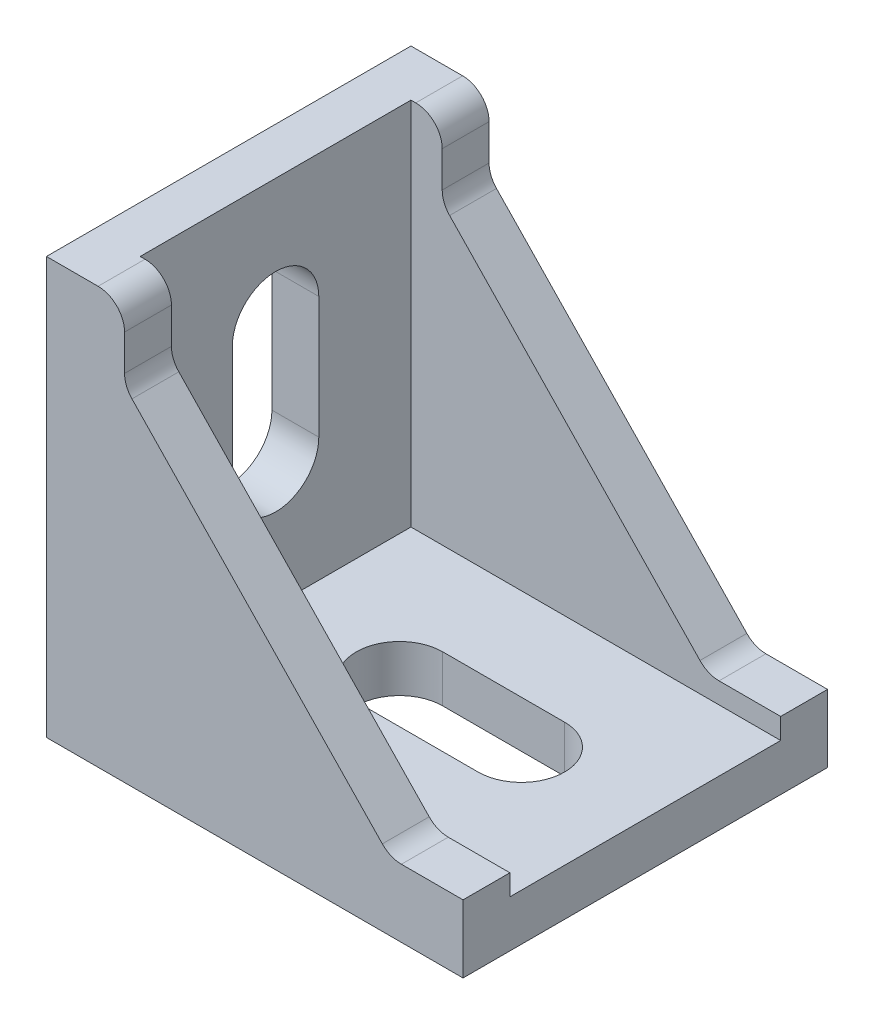
ISO-10303-21;
HEADER;
FILE_DESCRIPTION(('STEP AP214'),'2;1');
FILE_NAME('part.step','',(''),(''),'','','');
FILE_SCHEMA(('AUTOMOTIVE_DESIGN { 1 0 10303 214 1 1 1 1 }'));
ENDSEC;
DATA;
#1=APPLICATION_CONTEXT('core data for automotive mechanical design processes');
#2=APPLICATION_PROTOCOL_DEFINITION('international standard','automotive_design',2000,#1);
#3=PRODUCT_CONTEXT('',#1,'mechanical');
#4=PRODUCT('Part','Part','',(#3));
#5=PRODUCT_RELATED_PRODUCT_CATEGORY('part','',(#4));
#6=PRODUCT_DEFINITION_FORMATION('','',#4);
#7=PRODUCT_DEFINITION_CONTEXT('part definition',#1,'design');
#8=PRODUCT_DEFINITION('design','',#6,#7);
#9=PRODUCT_DEFINITION_SHAPE('','',#8);
#10=(LENGTH_UNIT() NAMED_UNIT(*) SI_UNIT(.MILLI.,.METRE.));
#11=(NAMED_UNIT(*) PLANE_ANGLE_UNIT() SI_UNIT($,.RADIAN.));
#12=(NAMED_UNIT(*) SI_UNIT($,.STERADIAN.) SOLID_ANGLE_UNIT());
#13=UNCERTAINTY_MEASURE_WITH_UNIT(LENGTH_MEASURE(1.E-05),#10,'distance_accuracy_value','');
#14=(GEOMETRIC_REPRESENTATION_CONTEXT(3) GLOBAL_UNCERTAINTY_ASSIGNED_CONTEXT((#13)) GLOBAL_UNIT_ASSIGNED_CONTEXT((#10,
#11,#12)) REPRESENTATION_CONTEXT('',''));
#15=CARTESIAN_POINT('',(0.,0.,0.));
#16=DIRECTION('',(0.,0.,1.));
#17=DIRECTION('',(1.,0.,0.));
#18=AXIS2_PLACEMENT_3D('',#15,#16,#17);
#19=CARTESIAN_POINT('',(-15.4999999999926,17.75,17.5));
#20=DIRECTION('',(-1.,0.,0.));
#21=DIRECTION('',(0.,0.,1.));
#22=AXIS2_PLACEMENT_3D('',#19,#20,#21);
#23=PLANE('',#22);
#24=DIRECTION('',(0.,-1.,0.));
#25=VECTOR('',#24,1.);
#26=CARTESIAN_POINT('',(-15.4999999999926,5.85,4.15));
#27=LINE('',#26,#25);
#28=CARTESIAN_POINT('',(-15.4999999999926,5.85,4.15));
#29=VERTEX_POINT('',#28);
#30=CARTESIAN_POINT('',(-15.4999999999926,-5.85,4.15));
#31=VERTEX_POINT('',#30);
#32=EDGE_CURVE('E282',#29,#31,#27,.T.);
#33=ORIENTED_EDGE('',*,*,#32,.F.);
#34=CARTESIAN_POINT('',(-15.4999999999926,5.85,0.));
#35=DIRECTION('',(1.,0.,0.));
#36=DIRECTION('',(0.,0.,-1.));
#37=AXIS2_PLACEMENT_3D('',#34,#35,#36);
#38=CIRCLE('',#37,4.15);
#39=CARTESIAN_POINT('',(-15.4999999999926,5.85,-4.15));
#40=VERTEX_POINT('',#39);
#41=EDGE_CURVE('E263',#40,#29,#38,.T.);
#42=ORIENTED_EDGE('',*,*,#41,.F.);
#43=DIRECTION('',(0.,1.,0.));
#44=VECTOR('',#43,1.);
#45=CARTESIAN_POINT('',(-15.4999999999926,5.85,-4.15));
#46=LINE('',#45,#44);
#47=CARTESIAN_POINT('',(-15.4999999999926,-5.85,-4.15));
#48=VERTEX_POINT('',#47);
#49=EDGE_CURVE('E271',#48,#40,#46,.T.);
#50=ORIENTED_EDGE('',*,*,#49,.F.);
#51=CARTESIAN_POINT('',(-15.4999999999926,-5.85,0.));
#52=DIRECTION('',(1.,0.,0.));
#53=DIRECTION('',(0.,0.,-1.));
#54=AXIS2_PLACEMENT_3D('',#51,#52,#53);
#55=CIRCLE('',#54,4.15);
#56=EDGE_CURVE('E285',#31,#48,#55,.T.);
#57=ORIENTED_EDGE('',*,*,#56,.F.);
#58=EDGE_LOOP('',(#33,#42,#50,#57));
#59=FACE_BOUND('',#58,.T.);
#60=DIRECTION('',(0.,-1.,0.));
#61=VECTOR('',#60,1.);
#62=CARTESIAN_POINT('',(-15.4999999999926,17.75,-13.));
#63=LINE('',#62,#61);
#64=CARTESIAN_POINT('',(-15.4999999999926,17.75,-13.));
#65=VERTEX_POINT('',#64);
#66=CARTESIAN_POINT('',(-15.4999999999926,-17.75,-13.));
#67=VERTEX_POINT('',#66);
#68=EDGE_CURVE('E299',#65,#67,#63,.T.);
#69=ORIENTED_EDGE('',*,*,#68,.F.);
#70=DIRECTION('',(0.,0.,-1.));
#71=VECTOR('',#70,1.);
#72=CARTESIAN_POINT('',(-15.4999999999926,17.75,17.5));
#73=LINE('',#72,#71);
#74=CARTESIAN_POINT('',(-15.4999999999926,17.75,13.));
#75=VERTEX_POINT('',#74);
#76=EDGE_CURVE('E390',#75,#65,#73,.T.);
#77=ORIENTED_EDGE('',*,*,#76,.F.);
#78=DIRECTION('',(0.,-1.,0.));
#79=VECTOR('',#78,1.);
#80=CARTESIAN_POINT('',(-15.4999999999926,17.75,13.));
#81=LINE('',#80,#79);
#82=CARTESIAN_POINT('',(-15.4999999999926,-17.75,13.));
#83=VERTEX_POINT('',#82);
#84=EDGE_CURVE('E329',#75,#83,#81,.T.);
#85=ORIENTED_EDGE('',*,*,#84,.T.);
#86=DIRECTION('',(0.,0.,-1.));
#87=VECTOR('',#86,1.);
#88=CARTESIAN_POINT('',(-15.4999999999926,-17.75,17.5));
#89=LINE('',#88,#87);
#90=EDGE_CURVE('E370',#83,#67,#89,.T.);
#91=ORIENTED_EDGE('',*,*,#90,.T.);
#92=EDGE_LOOP('',(#69,#77,#85,#91));
#93=FACE_BOUND('',#92,.T.);
#94=ADVANCED_FACE('F37',(#59,#93),#23,.F.);
#95=CARTESIAN_POINT('',(-15.4999999999926,-17.75,17.5));
#96=DIRECTION('',(0.,-1.,0.));
#97=DIRECTION('',(0.,0.,-1.));
#98=AXIS2_PLACEMENT_3D('',#95,#96,#97);
#99=PLANE('',#98);
#100=CARTESIAN_POINT('',(8.10000000000371,-17.75,0.));
#101=DIRECTION('',(0.,1.,0.));
#102=DIRECTION('',(0.,0.,1.));
#103=AXIS2_PLACEMENT_3D('',#100,#101,#102);
#104=CIRCLE('',#103,4.15);
#105=CARTESIAN_POINT('',(8.10000000000371,-17.75,4.15));
#106=VERTEX_POINT('',#105);
#107=CARTESIAN_POINT('',(8.10000000000371,-17.75,-4.15));
#108=VERTEX_POINT('',#107);
#109=EDGE_CURVE('E257',#106,#108,#104,.T.);
#110=ORIENTED_EDGE('',*,*,#109,.F.);
#111=DIRECTION('',(1.,0.,0.));
#112=VECTOR('',#111,1.);
#113=CARTESIAN_POINT('',(0.,-17.75,4.15));
#114=LINE('',#113,#112);
#115=CARTESIAN_POINT('',(-3.5999999999963,-17.75,4.15));
#116=VERTEX_POINT('',#115);
#117=EDGE_CURVE('E230',#116,#106,#114,.T.);
#118=ORIENTED_EDGE('',*,*,#117,.F.);
#119=CARTESIAN_POINT('',(-3.5999999999963,-17.75,0.));
#120=DIRECTION('',(0.,1.,0.));
#121=DIRECTION('',(0.,0.,1.));
#122=AXIS2_PLACEMENT_3D('',#119,#120,#121);
#123=CIRCLE('',#122,4.15);
#124=CARTESIAN_POINT('',(-3.5999999999963,-17.75,-4.15));
#125=VERTEX_POINT('',#124);
#126=EDGE_CURVE('E248',#125,#116,#123,.T.);
#127=ORIENTED_EDGE('',*,*,#126,.F.);
#128=DIRECTION('',(1.,0.,0.));
#129=VECTOR('',#128,1.);
#130=CARTESIAN_POINT('',(0.,-17.75,-4.15));
#131=LINE('',#130,#129);
#132=EDGE_CURVE('E251',#125,#108,#131,.T.);
#133=ORIENTED_EDGE('',*,*,#132,.T.);
#134=EDGE_LOOP('',(#110,#118,#127,#133));
#135=FACE_BOUND('',#134,.T.);
#136=DIRECTION('',(1.,0.,0.));
#137=VECTOR('',#136,1.);
#138=CARTESIAN_POINT('',(-15.4999999999926,-17.75,-13.));
#139=LINE('',#138,#137);
#140=CARTESIAN_POINT('',(20.,-17.75,-13.));
#141=VERTEX_POINT('',#140);
#142=EDGE_CURVE('E315',#67,#141,#139,.T.);
#143=ORIENTED_EDGE('',*,*,#142,.F.);
#144=ORIENTED_EDGE('',*,*,#90,.F.);
#145=DIRECTION('',(1.,0.,0.));
#146=VECTOR('',#145,1.);
#147=CARTESIAN_POINT('',(-15.4999999999926,-17.75,13.));
#148=LINE('',#147,#146);
#149=CARTESIAN_POINT('',(20.,-17.75,13.));
#150=VERTEX_POINT('',#149);
#151=EDGE_CURVE('E332',#83,#150,#148,.T.);
#152=ORIENTED_EDGE('',*,*,#151,.T.);
#153=DIRECTION('',(0.,0.,-1.));
#154=VECTOR('',#153,1.);
#155=CARTESIAN_POINT('',(20.,-17.75,17.5));
#156=LINE('',#155,#154);
#157=EDGE_CURVE('E379',#150,#141,#156,.T.);
#158=ORIENTED_EDGE('',*,*,#157,.T.);
#159=EDGE_LOOP('',(#143,#144,#152,#158));
#160=FACE_BOUND('',#159,.T.);
#161=ADVANCED_FACE('F510',(#135,#160),#99,.F.);
#162=CARTESIAN_POINT('',(-20.,17.75,17.5));
#163=DIRECTION('',(0.,-1.,0.));
#164=DIRECTION('',(1.,0.,0.));
#165=AXIS2_PLACEMENT_3D('',#162,#163,#164);
#166=PLANE('',#165);
#167=DIRECTION('',(-1.,0.,0.));
#168=VECTOR('',#167,1.);
#169=CARTESIAN_POINT('',(-15.4999999999926,17.75,-13.));
#170=LINE('',#169,#168);
#171=CARTESIAN_POINT('',(-15.0399999999926,17.75,-13.));
#172=VERTEX_POINT('',#171);
#173=EDGE_CURVE('E302',#172,#65,#170,.T.);
#174=ORIENTED_EDGE('',*,*,#173,.F.);
#175=DIRECTION('',(0.,0.,-1.));
#176=VECTOR('',#175,1.);
#177=CARTESIAN_POINT('',(-15.0399999999926,17.75,17.5));
#178=LINE('',#177,#176);
#179=CARTESIAN_POINT('',(-15.0399999999926,17.75,-17.5));
#180=VERTEX_POINT('',#179);
#181=EDGE_CURVE('E419',#172,#180,#178,.T.);
#182=ORIENTED_EDGE('',*,*,#181,.T.);
#183=DIRECTION('',(-1.,0.,0.));
#184=VECTOR('',#183,1.);
#185=CARTESIAN_POINT('',(-20.,17.75,-17.5));
#186=LINE('',#185,#184);
#187=CARTESIAN_POINT('',(-20.,17.75,-17.5));
#188=VERTEX_POINT('',#187);
#189=EDGE_CURVE('E360',#180,#188,#186,.T.);
#190=ORIENTED_EDGE('',*,*,#189,.T.);
#191=DIRECTION('',(0.,0.,-1.));
#192=VECTOR('',#191,1.);
#193=CARTESIAN_POINT('',(-20.,17.75,17.5));
#194=LINE('',#193,#192);
#195=CARTESIAN_POINT('',(-20.,17.75,17.5));
#196=VERTEX_POINT('',#195);
#197=EDGE_CURVE('E387',#196,#188,#194,.T.);
#198=ORIENTED_EDGE('',*,*,#197,.F.);
#199=DIRECTION('',(-1.,0.,0.));
#200=VECTOR('',#199,1.);
#201=CARTESIAN_POINT('',(-20.,17.75,17.5));
#202=LINE('',#201,#200);
#203=CARTESIAN_POINT('',(-15.0399999999926,17.75,17.5));
#204=VERTEX_POINT('',#203);
#205=EDGE_CURVE('E361',#204,#196,#202,.T.);
#206=ORIENTED_EDGE('',*,*,#205,.F.);
#207=DIRECTION('',(0.,0.,1.));
#208=VECTOR('',#207,1.);
#209=CARTESIAN_POINT('',(-15.0399999999926,17.75,13.));
#210=LINE('',#209,#208);
#211=CARTESIAN_POINT('',(-15.0399999999926,17.75,13.));
#212=VERTEX_POINT('',#211);
#213=EDGE_CURVE('E60',#204,#212,#210,.F.);
#214=ORIENTED_EDGE('',*,*,#213,.T.);
#215=DIRECTION('',(-1.,0.,0.));
#216=VECTOR('',#215,1.);
#217=CARTESIAN_POINT('',(-15.4999999999926,17.75,13.));
#218=LINE('',#217,#216);
#219=EDGE_CURVE('E348',#212,#75,#218,.T.);
#220=ORIENTED_EDGE('',*,*,#219,.T.);
#221=ORIENTED_EDGE('',*,*,#76,.T.);
#222=EDGE_LOOP('',(#174,#182,#190,#198,#206,#214,#220,#221));
#223=FACE_BOUND('',#222,.T.);
#224=ADVANCED_FACE('F462',(#223),#166,.F.);
#225=CARTESIAN_POINT('',(-20.,-22.25,17.5));
#226=DIRECTION('',(1.,0.,0.));
#227=DIRECTION('',(0.,1.,0.));
#228=AXIS2_PLACEMENT_3D('',#225,#226,#227);
#229=PLANE('',#228);
#230=DIRECTION('',(0.,1.,0.));
#231=VECTOR('',#230,1.);
#232=CARTESIAN_POINT('',(-20.,5.85,-4.15));
#233=LINE('',#232,#231);
#234=CARTESIAN_POINT('',(-20.,-5.85,-4.15));
#235=VERTEX_POINT('',#234);
#236=CARTESIAN_POINT('',(-20.,5.85,-4.15));
#237=VERTEX_POINT('',#236);
#238=EDGE_CURVE('E277',#235,#237,#233,.T.);
#239=ORIENTED_EDGE('',*,*,#238,.T.);
#240=CARTESIAN_POINT('',(-20.,5.85,0.));
#241=DIRECTION('',(1.,0.,0.));
#242=DIRECTION('',(0.,0.,-1.));
#243=AXIS2_PLACEMENT_3D('',#240,#241,#242);
#244=CIRCLE('',#243,4.15);
#245=CARTESIAN_POINT('',(-20.,5.85,4.15));
#246=VERTEX_POINT('',#245);
#247=EDGE_CURVE('E267',#237,#246,#244,.T.);
#248=ORIENTED_EDGE('',*,*,#247,.T.);
#249=DIRECTION('',(0.,-1.,0.));
#250=VECTOR('',#249,1.);
#251=CARTESIAN_POINT('',(-20.,5.85,4.15));
#252=LINE('',#251,#250);
#253=CARTESIAN_POINT('',(-20.,-5.85,4.15));
#254=VERTEX_POINT('',#253);
#255=EDGE_CURVE('E270',#246,#254,#252,.T.);
#256=ORIENTED_EDGE('',*,*,#255,.T.);
#257=CARTESIAN_POINT('',(-20.,-5.85,0.));
#258=DIRECTION('',(1.,0.,0.));
#259=DIRECTION('',(0.,0.,-1.));
#260=AXIS2_PLACEMENT_3D('',#257,#258,#259);
#261=CIRCLE('',#260,4.15);
#262=EDGE_CURVE('E274',#254,#235,#261,.T.);
#263=ORIENTED_EDGE('',*,*,#262,.T.);
#264=EDGE_LOOP('',(#239,#248,#256,#263));
#265=FACE_BOUND('',#264,.T.);
#266=DIRECTION('',(0.,-1.,0.));
#267=VECTOR('',#266,1.);
#268=CARTESIAN_POINT('',(-20.,-22.25,-17.5));
#269=LINE('',#268,#267);
#270=CARTESIAN_POINT('',(-20.,-22.25,-17.5));
#271=VERTEX_POINT('',#270);
#272=EDGE_CURVE('E372',#188,#271,#269,.T.);
#273=ORIENTED_EDGE('',*,*,#272,.T.);
#274=DIRECTION('',(0.,0.,-1.));
#275=VECTOR('',#274,1.);
#276=CARTESIAN_POINT('',(-20.,-22.25,17.5));
#277=LINE('',#276,#275);
#278=CARTESIAN_POINT('',(-20.,-22.25,17.5));
#279=VERTEX_POINT('',#278);
#280=EDGE_CURVE('E384',#279,#271,#277,.T.);
#281=ORIENTED_EDGE('',*,*,#280,.F.);
#282=DIRECTION('',(0.,-1.,0.));
#283=VECTOR('',#282,1.);
#284=CARTESIAN_POINT('',(-20.,-22.25,17.5));
#285=LINE('',#284,#283);
#286=EDGE_CURVE('E363',#196,#279,#285,.T.);
#287=ORIENTED_EDGE('',*,*,#286,.F.);
#288=ORIENTED_EDGE('',*,*,#197,.T.);
#289=EDGE_LOOP('',(#273,#281,#287,#288));
#290=FACE_BOUND('',#289,.T.);
#291=ADVANCED_FACE('F469',(#265,#290),#229,.F.);
#292=CARTESIAN_POINT('',(-20.,-22.25,17.5));
#293=DIRECTION('',(0.,1.,0.));
#294=DIRECTION('',(0.,0.,1.));
#295=AXIS2_PLACEMENT_3D('',#292,#293,#294);
#296=PLANE('',#295);
#297=CARTESIAN_POINT('',(-3.5999999999963,-22.25,0.));
#298=DIRECTION('',(0.,1.,0.));
#299=DIRECTION('',(0.,0.,1.));
#300=AXIS2_PLACEMENT_3D('',#297,#298,#299);
#301=CIRCLE('',#300,4.15);
#302=CARTESIAN_POINT('',(-3.5999999999963,-22.25,-4.15));
#303=VERTEX_POINT('',#302);
#304=CARTESIAN_POINT('',(-3.5999999999963,-22.25,4.15));
#305=VERTEX_POINT('',#304);
#306=EDGE_CURVE('E235',#303,#305,#301,.T.);
#307=ORIENTED_EDGE('',*,*,#306,.T.);
#308=DIRECTION('',(1.,0.,0.));
#309=VECTOR('',#308,1.);
#310=CARTESIAN_POINT('',(0.,-22.25,4.15));
#311=LINE('',#310,#309);
#312=CARTESIAN_POINT('',(8.10000000000371,-22.25,4.15));
#313=VERTEX_POINT('',#312);
#314=EDGE_CURVE('E227',#305,#313,#311,.T.);
#315=ORIENTED_EDGE('',*,*,#314,.T.);
#316=CARTESIAN_POINT('',(8.10000000000371,-22.25,0.));
#317=DIRECTION('',(0.,1.,0.));
#318=DIRECTION('',(0.,0.,1.));
#319=AXIS2_PLACEMENT_3D('',#316,#317,#318);
#320=CIRCLE('',#319,4.15);
#321=CARTESIAN_POINT('',(8.10000000000371,-22.25,-4.15));
#322=VERTEX_POINT('',#321);
#323=EDGE_CURVE('E238',#313,#322,#320,.T.);
#324=ORIENTED_EDGE('',*,*,#323,.T.);
#325=DIRECTION('',(1.,0.,0.));
#326=VECTOR('',#325,1.);
#327=CARTESIAN_POINT('',(0.,-22.25,-4.15));
#328=LINE('',#327,#326);
#329=EDGE_CURVE('E243',#303,#322,#328,.T.);
#330=ORIENTED_EDGE('',*,*,#329,.F.);
#331=EDGE_LOOP('',(#307,#315,#324,#330));
#332=FACE_BOUND('',#331,.T.);
#333=DIRECTION('',(1.,0.,0.));
#334=VECTOR('',#333,1.);
#335=CARTESIAN_POINT('',(-20.,-22.25,-17.5));
#336=LINE('',#335,#334);
#337=CARTESIAN_POINT('',(20.,-22.25,-17.5));
#338=VERTEX_POINT('',#337);
#339=EDGE_CURVE('E374',#271,#338,#336,.T.);
#340=ORIENTED_EDGE('',*,*,#339,.T.);
#341=DIRECTION('',(0.,0.,-1.));
#342=VECTOR('',#341,1.);
#343=CARTESIAN_POINT('',(20.,-22.25,17.5));
#344=LINE('',#343,#342);
#345=CARTESIAN_POINT('',(20.,-22.25,17.5));
#346=VERTEX_POINT('',#345);
#347=EDGE_CURVE('E381',#346,#338,#344,.T.);
#348=ORIENTED_EDGE('',*,*,#347,.F.);
#349=DIRECTION('',(1.,0.,0.));
#350=VECTOR('',#349,1.);
#351=CARTESIAN_POINT('',(-20.,-22.25,17.5));
#352=LINE('',#351,#350);
#353=EDGE_CURVE('E366',#279,#346,#352,.T.);
#354=ORIENTED_EDGE('',*,*,#353,.F.);
#355=ORIENTED_EDGE('',*,*,#280,.T.);
#356=EDGE_LOOP('',(#340,#348,#354,#355));
#357=FACE_BOUND('',#356,.T.);
#358=ADVANCED_FACE('F245',(#332,#357),#296,.F.);
#359=CARTESIAN_POINT('',(20.,-17.75,17.5));
#360=DIRECTION('',(-1.,0.,0.));
#361=DIRECTION('',(0.,0.,1.));
#362=AXIS2_PLACEMENT_3D('',#359,#360,#361);
#363=PLANE('',#362);
#364=DIRECTION('',(0.,1.,0.));
#365=VECTOR('',#364,1.);
#366=CARTESIAN_POINT('',(20.,-17.75,-17.5));
#367=LINE('',#366,#365);
#368=CARTESIAN_POINT('',(20.,-15.75,-17.5));
#369=VERTEX_POINT('',#368);
#370=EDGE_CURVE('E364',#338,#369,#367,.T.);
#371=ORIENTED_EDGE('',*,*,#370,.T.);
#372=DIRECTION('',(0.,0.,-1.));
#373=VECTOR('',#372,1.);
#374=CARTESIAN_POINT('',(20.,-15.75,-13.));
#375=LINE('',#374,#373);
#376=CARTESIAN_POINT('',(20.,-15.75,-13.));
#377=VERTEX_POINT('',#376);
#378=EDGE_CURVE('E318',#377,#369,#375,.T.);
#379=ORIENTED_EDGE('',*,*,#378,.F.);
#380=DIRECTION('',(0.,1.,0.));
#381=VECTOR('',#380,1.);
#382=CARTESIAN_POINT('',(20.,-15.75,-13.));
#383=LINE('',#382,#381);
#384=EDGE_CURVE('E313',#141,#377,#383,.T.);
#385=ORIENTED_EDGE('',*,*,#384,.F.);
#386=ORIENTED_EDGE('',*,*,#157,.F.);
#387=DIRECTION('',(0.,1.,0.));
#388=VECTOR('',#387,1.);
#389=CARTESIAN_POINT('',(20.,-15.75,13.));
#390=LINE('',#389,#388);
#391=CARTESIAN_POINT('',(20.,-15.75,13.));
#392=VERTEX_POINT('',#391);
#393=EDGE_CURVE('E336',#150,#392,#390,.T.);
#394=ORIENTED_EDGE('',*,*,#393,.T.);
#395=DIRECTION('',(0.,0.,1.));
#396=VECTOR('',#395,1.);
#397=CARTESIAN_POINT('',(20.,-15.75,13.));
#398=LINE('',#397,#396);
#399=CARTESIAN_POINT('',(20.,-15.75,17.5));
#400=VERTEX_POINT('',#399);
#401=EDGE_CURVE('E350',#392,#400,#398,.T.);
#402=ORIENTED_EDGE('',*,*,#401,.T.);
#403=DIRECTION('',(0.,1.,0.));
#404=VECTOR('',#403,1.);
#405=CARTESIAN_POINT('',(20.,-17.75,17.5));
#406=LINE('',#405,#404);
#407=EDGE_CURVE('E368',#346,#400,#406,.T.);
#408=ORIENTED_EDGE('',*,*,#407,.F.);
#409=ORIENTED_EDGE('',*,*,#347,.T.);
#410=EDGE_LOOP('',(#371,#379,#385,#386,#394,#402,#408,#409));
#411=FACE_BOUND('',#410,.T.);
#412=ADVANCED_FACE('F505',(#411),#363,.F.);
#413=CARTESIAN_POINT('',(0.,0.,17.5));
#414=DIRECTION('',(0.,0.,1.));
#415=DIRECTION('',(1.,0.,0.));
#416=AXIS2_PLACEMENT_3D('',#413,#414,#415);
#417=PLANE('',#416);
#418=DIRECTION('',(0.,1.,0.));
#419=VECTOR('',#418,1.);
#420=CARTESIAN_POINT('',(-12.4999999999926,17.75,17.5));
#421=LINE('',#420,#419);
#422=CARTESIAN_POINT('',(-12.4999999999926,11.7736051680798,17.5));
#423=VERTEX_POINT('',#422);
#424=CARTESIAN_POINT('',(-12.4999999999926,15.21,17.5));
#425=VERTEX_POINT('',#424);
#426=EDGE_CURVE('E333',#423,#425,#421,.T.);
#427=ORIENTED_EDGE('',*,*,#426,.T.);
#428=CARTESIAN_POINT('',(-15.0399999999926,15.21,17.5));
#429=DIRECTION('',(0.,0.,1.));
#430=DIRECTION('',(1.,0.,0.));
#431=AXIS2_PLACEMENT_3D('',#428,#429,#430);
#432=CIRCLE('',#431,2.54);
#433=EDGE_CURVE('E425',#425,#204,#432,.T.);
#434=ORIENTED_EDGE('',*,*,#433,.T.);
#435=ORIENTED_EDGE('',*,*,#205,.T.);
#436=ORIENTED_EDGE('',*,*,#286,.T.);
#437=ORIENTED_EDGE('',*,*,#353,.T.);
#438=ORIENTED_EDGE('',*,*,#407,.T.);
#439=DIRECTION('',(-1.,0.,0.));
#440=VECTOR('',#439,1.);
#441=CARTESIAN_POINT('',(13.,-15.75,17.5));
#442=LINE('',#441,#440);
#443=CARTESIAN_POINT('',(14.0808276145678,-15.75,17.5));
#444=VERTEX_POINT('',#443);
#445=EDGE_CURVE('E328',#400,#444,#442,.T.);
#446=ORIENTED_EDGE('',*,*,#445,.T.);
#447=CARTESIAN_POINT('',(14.0808276145678,-13.21,17.5));
#448=DIRECTION('',(0.,0.,1.));
#449=DIRECTION('',(1.,0.,0.));
#450=AXIS2_PLACEMENT_3D('',#447,#448,#449);
#451=CIRCLE('',#450,2.54);
#452=CARTESIAN_POINT('',(12.250575346671,-14.9711861445794,17.5));
#453=VERTEX_POINT('',#452);
#454=EDGE_CURVE('E433',#444,#453,#451,.F.);
#455=ORIENTED_EDGE('',*,*,#454,.T.);
#456=DIRECTION('',(-0.693380371881668,0.720571759014492,0.));
#457=VECTOR('',#456,1.);
#458=CARTESIAN_POINT('',(-12.4999999999926,10.75,17.5));
#459=LINE('',#458,#457);
#460=CARTESIAN_POINT('',(-11.7902522678894,10.0124190235004,17.5));
#461=VERTEX_POINT('',#460);
#462=EDGE_CURVE('E353',#453,#461,#459,.T.);
#463=ORIENTED_EDGE('',*,*,#462,.T.);
#464=CARTESIAN_POINT('',(-9.95999999999259,11.7736051680798,17.5));
#465=DIRECTION('',(0.,0.,1.));
#466=DIRECTION('',(1.,0.,0.));
#467=AXIS2_PLACEMENT_3D('',#464,#465,#466);
#468=CIRCLE('',#467,2.54);
#469=EDGE_CURVE('E437',#461,#423,#468,.F.);
#470=ORIENTED_EDGE('',*,*,#469,.T.);
#471=EDGE_LOOP('',(#427,#434,#435,#436,#437,#438,#446,#455,#463,#470));
#472=FACE_BOUND('',#471,.T.);
#473=ADVANCED_FACE('F475',(#472),#417,.T.);
#474=CARTESIAN_POINT('',(0.,0.,-17.5));
#475=DIRECTION('',(0.,0.,1.));
#476=DIRECTION('',(1.,0.,0.));
#477=AXIS2_PLACEMENT_3D('',#474,#475,#476);
#478=PLANE('',#477);
#479=ORIENTED_EDGE('',*,*,#189,.F.);
#480=CARTESIAN_POINT('',(-15.0399999999926,15.21,-17.5));
#481=DIRECTION('',(0.,0.,1.));
#482=DIRECTION('',(1.,0.,0.));
#483=AXIS2_PLACEMENT_3D('',#480,#481,#482);
#484=CIRCLE('',#483,2.54);
#485=CARTESIAN_POINT('',(-12.4999999999926,15.21,-17.5));
#486=VERTEX_POINT('',#485);
#487=EDGE_CURVE('E422',#180,#486,#484,.F.);
#488=ORIENTED_EDGE('',*,*,#487,.T.);
#489=DIRECTION('',(0.,1.,0.));
#490=VECTOR('',#489,1.);
#491=CARTESIAN_POINT('',(-12.4999999999926,17.75,-17.5));
#492=LINE('',#491,#490);
#493=CARTESIAN_POINT('',(-12.4999999999926,11.7736051680798,-17.5));
#494=VERTEX_POINT('',#493);
#495=EDGE_CURVE('E292',#494,#486,#492,.T.);
#496=ORIENTED_EDGE('',*,*,#495,.F.);
#497=CARTESIAN_POINT('',(-9.95999999999259,11.7736051680798,-17.5));
#498=DIRECTION('',(0.,0.,1.));
#499=DIRECTION('',(1.,0.,0.));
#500=AXIS2_PLACEMENT_3D('',#497,#498,#499);
#501=CIRCLE('',#500,2.54);
#502=CARTESIAN_POINT('',(-11.7902522678894,10.0124190235004,-17.5));
#503=VERTEX_POINT('',#502);
#504=EDGE_CURVE('E45',#494,#503,#501,.T.);
#505=ORIENTED_EDGE('',*,*,#504,.T.);
#506=DIRECTION('',(-0.693380371881668,0.720571759014492,0.));
#507=VECTOR('',#506,1.);
#508=CARTESIAN_POINT('',(-12.4999999999926,10.75,-17.5));
#509=LINE('',#508,#507);
#510=CARTESIAN_POINT('',(12.250575346671,-14.9711861445794,-17.5));
#511=VERTEX_POINT('',#510);
#512=EDGE_CURVE('E321',#511,#503,#509,.T.);
#513=ORIENTED_EDGE('',*,*,#512,.F.);
#514=CARTESIAN_POINT('',(14.0808276145678,-13.21,-17.5));
#515=DIRECTION('',(0.,0.,1.));
#516=DIRECTION('',(1.,0.,0.));
#517=AXIS2_PLACEMENT_3D('',#514,#515,#516);
#518=CIRCLE('',#517,2.54);
#519=CARTESIAN_POINT('',(14.0808276145678,-15.75,-17.5));
#520=VERTEX_POINT('',#519);
#521=EDGE_CURVE('E429',#511,#520,#518,.T.);
#522=ORIENTED_EDGE('',*,*,#521,.T.);
#523=DIRECTION('',(-1.,0.,0.));
#524=VECTOR('',#523,1.);
#525=CARTESIAN_POINT('',(13.,-15.75,-17.5));
#526=LINE('',#525,#524);
#527=EDGE_CURVE('E303',#369,#520,#526,.T.);
#528=ORIENTED_EDGE('',*,*,#527,.F.);
#529=ORIENTED_EDGE('',*,*,#370,.F.);
#530=ORIENTED_EDGE('',*,*,#339,.F.);
#531=ORIENTED_EDGE('',*,*,#272,.F.);
#532=EDGE_LOOP('',(#479,#488,#496,#505,#513,#522,#528,#529,#530,#531));
#533=FACE_BOUND('',#532,.T.);
#534=ADVANCED_FACE('F444',(#533),#478,.F.);
#535=CARTESIAN_POINT('',(-12.4999999999926,17.75,13.));
#536=DIRECTION('',(1.,0.,0.));
#537=DIRECTION('',(0.,0.,-1.));
#538=AXIS2_PLACEMENT_3D('',#535,#536,#537);
#539=PLANE('',#538);
#540=ORIENTED_EDGE('',*,*,#426,.F.);
#541=DIRECTION('',(0.,0.,1.));
#542=VECTOR('',#541,1.);
#543=CARTESIAN_POINT('',(-12.4999999999926,11.7736051680798,13.));
#544=LINE('',#543,#542);
#545=CARTESIAN_POINT('',(-12.4999999999926,11.7736051680798,13.));
#546=VERTEX_POINT('',#545);
#547=EDGE_CURVE('E411',#423,#546,#544,.F.);
#548=ORIENTED_EDGE('',*,*,#547,.T.);
#549=DIRECTION('',(0.,1.,0.));
#550=VECTOR('',#549,1.);
#551=CARTESIAN_POINT('',(-12.4999999999926,17.75,13.));
#552=LINE('',#551,#550);
#553=CARTESIAN_POINT('',(-12.4999999999926,15.21,13.));
#554=VERTEX_POINT('',#553);
#555=EDGE_CURVE('E345',#546,#554,#552,.T.);
#556=ORIENTED_EDGE('',*,*,#555,.T.);
#557=DIRECTION('',(0.,0.,1.));
#558=VECTOR('',#557,1.);
#559=CARTESIAN_POINT('',(-12.4999999999926,15.21,17.5));
#560=LINE('',#559,#558);
#561=EDGE_CURVE('E408',#554,#425,#560,.T.);
#562=ORIENTED_EDGE('',*,*,#561,.T.);
#563=EDGE_LOOP('',(#540,#548,#556,#562));
#564=FACE_BOUND('',#563,.T.);
#565=ADVANCED_FACE('F486',(#564),#539,.T.);
#566=CARTESIAN_POINT('',(-12.4999999999926,10.75,13.));
#567=DIRECTION('',(0.720571759014492,0.693380371881668,0.));
#568=DIRECTION('',(-0.693380371881668,0.720571759014492,0.));
#569=AXIS2_PLACEMENT_3D('',#566,#567,#568);
#570=PLANE('',#569);
#571=ORIENTED_EDGE('',*,*,#462,.F.);
#572=DIRECTION('',(0.,0.,1.));
#573=VECTOR('',#572,1.);
#574=CARTESIAN_POINT('',(12.250575346671,-14.9711861445794,13.));
#575=LINE('',#574,#573);
#576=CARTESIAN_POINT('',(12.250575346671,-14.9711861445794,13.));
#577=VERTEX_POINT('',#576);
#578=EDGE_CURVE('E406',#453,#577,#575,.F.);
#579=ORIENTED_EDGE('',*,*,#578,.T.);
#580=DIRECTION('',(-0.693380371881668,0.720571759014492,0.));
#581=VECTOR('',#580,1.);
#582=CARTESIAN_POINT('',(-12.4999999999926,10.75,13.));
#583=LINE('',#582,#581);
#584=CARTESIAN_POINT('',(-11.7902522678894,10.0124190235004,13.));
#585=VERTEX_POINT('',#584);
#586=EDGE_CURVE('E342',#577,#585,#583,.T.);
#587=ORIENTED_EDGE('',*,*,#586,.T.);
#588=DIRECTION('',(0.,0.,1.));
#589=VECTOR('',#588,1.);
#590=CARTESIAN_POINT('',(-11.7902522678894,10.0124190235004,17.5));
#591=LINE('',#590,#589);
#592=EDGE_CURVE('E403',#585,#461,#591,.T.);
#593=ORIENTED_EDGE('',*,*,#592,.T.);
#594=EDGE_LOOP('',(#571,#579,#587,#593));
#595=FACE_BOUND('',#594,.T.);
#596=ADVANCED_FACE('F495',(#595),#570,.T.);
#597=CARTESIAN_POINT('',(13.,-15.75,13.));
#598=DIRECTION('',(0.,1.,0.));
#599=DIRECTION('',(0.,0.,1.));
#600=AXIS2_PLACEMENT_3D('',#597,#598,#599);
#601=PLANE('',#600);
#602=DIRECTION('',(-1.,0.,0.));
#603=VECTOR('',#602,1.);
#604=CARTESIAN_POINT('',(13.,-15.75,13.));
#605=LINE('',#604,#603);
#606=CARTESIAN_POINT('',(14.0808276145678,-15.75,13.));
#607=VERTEX_POINT('',#606);
#608=EDGE_CURVE('E339',#392,#607,#605,.T.);
#609=ORIENTED_EDGE('',*,*,#608,.T.);
#610=DIRECTION('',(0.,0.,1.));
#611=VECTOR('',#610,1.);
#612=CARTESIAN_POINT('',(14.0808276145678,-15.75,17.5));
#613=LINE('',#612,#611);
#614=EDGE_CURVE('E400',#607,#444,#613,.T.);
#615=ORIENTED_EDGE('',*,*,#614,.T.);
#616=ORIENTED_EDGE('',*,*,#445,.F.);
#617=ORIENTED_EDGE('',*,*,#401,.F.);
#618=EDGE_LOOP('',(#609,#615,#616,#617));
#619=FACE_BOUND('',#618,.T.);
#620=ADVANCED_FACE('F502',(#619),#601,.T.);
#621=CARTESIAN_POINT('',(0.,0.,13.));
#622=DIRECTION('',(0.,0.,1.));
#623=DIRECTION('',(1.,0.,0.));
#624=AXIS2_PLACEMENT_3D('',#621,#622,#623);
#625=PLANE('',#624);
#626=ORIENTED_EDGE('',*,*,#219,.F.);
#627=CARTESIAN_POINT('',(-15.0399999999926,15.21,13.));
#628=DIRECTION('',(0.,0.,1.));
#629=DIRECTION('',(1.,0.,0.));
#630=AXIS2_PLACEMENT_3D('',#627,#628,#629);
#631=CIRCLE('',#630,2.54);
#632=EDGE_CURVE('E427',#212,#554,#631,.F.);
#633=ORIENTED_EDGE('',*,*,#632,.T.);
#634=ORIENTED_EDGE('',*,*,#555,.F.);
#635=CARTESIAN_POINT('',(-9.95999999999259,11.7736051680798,13.));
#636=DIRECTION('',(0.,0.,1.));
#637=DIRECTION('',(1.,0.,0.));
#638=AXIS2_PLACEMENT_3D('',#635,#636,#637);
#639=CIRCLE('',#638,2.54);
#640=EDGE_CURVE('E439',#546,#585,#639,.T.);
#641=ORIENTED_EDGE('',*,*,#640,.T.);
#642=ORIENTED_EDGE('',*,*,#586,.F.);
#643=CARTESIAN_POINT('',(14.0808276145678,-13.21,13.));
#644=DIRECTION('',(0.,0.,1.));
#645=DIRECTION('',(1.,0.,0.));
#646=AXIS2_PLACEMENT_3D('',#643,#644,#645);
#647=CIRCLE('',#646,2.54);
#648=EDGE_CURVE('E435',#577,#607,#647,.T.);
#649=ORIENTED_EDGE('',*,*,#648,.T.);
#650=ORIENTED_EDGE('',*,*,#608,.F.);
#651=ORIENTED_EDGE('',*,*,#393,.F.);
#652=ORIENTED_EDGE('',*,*,#151,.F.);
#653=ORIENTED_EDGE('',*,*,#84,.F.);
#654=EDGE_LOOP('',(#626,#633,#634,#641,#642,#649,#650,#651,#652,#653));
#655=FACE_BOUND('',#654,.T.);
#656=ADVANCED_FACE('F481',(#655),#625,.F.);
#657=CARTESIAN_POINT('',(13.,-15.75,-13.));
#658=DIRECTION('',(0.,-1.,0.));
#659=DIRECTION('',(0.,0.,-1.));
#660=AXIS2_PLACEMENT_3D('',#657,#658,#659);
#661=PLANE('',#660);
#662=ORIENTED_EDGE('',*,*,#527,.T.);
#663=DIRECTION('',(0.,0.,-1.));
#664=VECTOR('',#663,1.);
#665=CARTESIAN_POINT('',(14.0808276145678,-15.75,-13.));
#666=LINE('',#665,#664);
#667=CARTESIAN_POINT('',(14.0808276145678,-15.75,-13.));
#668=VERTEX_POINT('',#667);
#669=EDGE_CURVE('E398',#520,#668,#666,.F.);
#670=ORIENTED_EDGE('',*,*,#669,.T.);
#671=DIRECTION('',(-1.,0.,0.));
#672=VECTOR('',#671,1.);
#673=CARTESIAN_POINT('',(13.,-15.75,-13.));
#674=LINE('',#673,#672);
#675=EDGE_CURVE('E310',#377,#668,#674,.T.);
#676=ORIENTED_EDGE('',*,*,#675,.F.);
#677=ORIENTED_EDGE('',*,*,#378,.T.);
#678=EDGE_LOOP('',(#662,#670,#676,#677));
#679=FACE_BOUND('',#678,.T.);
#680=ADVANCED_FACE('F518',(#679),#661,.F.);
#681=CARTESIAN_POINT('',(-12.4999999999926,10.75,-13.));
#682=DIRECTION('',(-0.720571759014492,-0.693380371881668,0.));
#683=DIRECTION('',(0.693380371881668,-0.720571759014492,0.));
#684=AXIS2_PLACEMENT_3D('',#681,#682,#683);
#685=PLANE('',#684);
#686=DIRECTION('',(-0.693380371881668,0.720571759014492,0.));
#687=VECTOR('',#686,1.);
#688=CARTESIAN_POINT('',(-12.4999999999926,10.75,-13.));
#689=LINE('',#688,#687);
#690=CARTESIAN_POINT('',(12.250575346671,-14.9711861445794,-13.));
#691=VERTEX_POINT('',#690);
#692=CARTESIAN_POINT('',(-11.7902522678894,10.0124190235004,-13.));
#693=VERTEX_POINT('',#692);
#694=EDGE_CURVE('E307',#691,#693,#689,.T.);
#695=ORIENTED_EDGE('',*,*,#694,.F.);
#696=DIRECTION('',(0.,0.,-1.));
#697=VECTOR('',#696,1.);
#698=CARTESIAN_POINT('',(12.250575346671,-14.9711861445794,-17.5));
#699=LINE('',#698,#697);
#700=EDGE_CURVE('E395',#691,#511,#699,.T.);
#701=ORIENTED_EDGE('',*,*,#700,.T.);
#702=ORIENTED_EDGE('',*,*,#512,.T.);
#703=DIRECTION('',(0.,0.,-1.));
#704=VECTOR('',#703,1.);
#705=CARTESIAN_POINT('',(-11.7902522678894,10.0124190235004,-13.));
#706=LINE('',#705,#704);
#707=EDGE_CURVE('E393',#503,#693,#706,.F.);
#708=ORIENTED_EDGE('',*,*,#707,.T.);
#709=EDGE_LOOP('',(#695,#701,#702,#708));
#710=FACE_BOUND('',#709,.T.);
#711=ADVANCED_FACE('F450',(#710),#685,.F.);
#712=CARTESIAN_POINT('',(-12.4999999999926,17.75,-13.));
#713=DIRECTION('',(-1.,0.,0.));
#714=DIRECTION('',(0.,0.,1.));
#715=AXIS2_PLACEMENT_3D('',#712,#713,#714);
#716=PLANE('',#715);
#717=DIRECTION('',(0.,1.,0.));
#718=VECTOR('',#717,1.);
#719=CARTESIAN_POINT('',(-12.4999999999926,17.75,-13.));
#720=LINE('',#719,#718);
#721=CARTESIAN_POINT('',(-12.4999999999926,11.7736051680798,-13.));
#722=VERTEX_POINT('',#721);
#723=CARTESIAN_POINT('',(-12.4999999999926,15.21,-13.));
#724=VERTEX_POINT('',#723);
#725=EDGE_CURVE('E305',#722,#724,#720,.T.);
#726=ORIENTED_EDGE('',*,*,#725,.F.);
#727=DIRECTION('',(0.,0.,-1.));
#728=VECTOR('',#727,1.);
#729=CARTESIAN_POINT('',(-12.4999999999926,11.7736051680798,-17.5));
#730=LINE('',#729,#728);
#731=EDGE_CURVE('E415',#722,#494,#730,.T.);
#732=ORIENTED_EDGE('',*,*,#731,.T.);
#733=ORIENTED_EDGE('',*,*,#495,.T.);
#734=DIRECTION('',(0.,0.,-1.));
#735=VECTOR('',#734,1.);
#736=CARTESIAN_POINT('',(-12.4999999999926,15.21,-13.));
#737=LINE('',#736,#735);
#738=EDGE_CURVE('E413',#486,#724,#737,.F.);
#739=ORIENTED_EDGE('',*,*,#738,.T.);
#740=EDGE_LOOP('',(#726,#732,#733,#739));
#741=FACE_BOUND('',#740,.T.);
#742=ADVANCED_FACE('F457',(#741),#716,.F.);
#743=CARTESIAN_POINT('',(0.,0.,-13.));
#744=DIRECTION('',(0.,0.,-1.));
#745=DIRECTION('',(1.,0.,0.));
#746=AXIS2_PLACEMENT_3D('',#743,#744,#745);
#747=PLANE('',#746);
#748=ORIENTED_EDGE('',*,*,#725,.T.);
#749=CARTESIAN_POINT('',(-15.0399999999926,15.21,-13.));
#750=DIRECTION('',(0.,0.,-1.));
#751=DIRECTION('',(-1.,0.,0.));
#752=AXIS2_PLACEMENT_3D('',#749,#750,#751);
#753=CIRCLE('',#752,2.54);
#754=EDGE_CURVE('E52',#724,#172,#753,.F.);
#755=ORIENTED_EDGE('',*,*,#754,.T.);
#756=ORIENTED_EDGE('',*,*,#173,.T.);
#757=ORIENTED_EDGE('',*,*,#68,.T.);
#758=ORIENTED_EDGE('',*,*,#142,.T.);
#759=ORIENTED_EDGE('',*,*,#384,.T.);
#760=ORIENTED_EDGE('',*,*,#675,.T.);
#761=CARTESIAN_POINT('',(14.0808276145678,-13.21,-13.));
#762=DIRECTION('',(0.,0.,-1.));
#763=DIRECTION('',(-1.,0.,0.));
#764=AXIS2_PLACEMENT_3D('',#761,#762,#763);
#765=CIRCLE('',#764,2.54);
#766=EDGE_CURVE('E431',#668,#691,#765,.T.);
#767=ORIENTED_EDGE('',*,*,#766,.T.);
#768=ORIENTED_EDGE('',*,*,#694,.T.);
#769=CARTESIAN_POINT('',(-9.95999999999259,11.7736051680798,-13.));
#770=DIRECTION('',(0.,0.,-1.));
#771=DIRECTION('',(-1.,0.,0.));
#772=AXIS2_PLACEMENT_3D('',#769,#770,#771);
#773=CIRCLE('',#772,2.54);
#774=EDGE_CURVE('E11',#693,#722,#773,.T.);
#775=ORIENTED_EDGE('',*,*,#774,.T.);
#776=EDGE_LOOP('',(#748,#755,#756,#757,#758,#759,#760,#767,#768,#775));
#777=FACE_BOUND('',#776,.T.);
#778=ADVANCED_FACE('F455',(#777),#747,.F.);
#779=CARTESIAN_POINT('',(-20.,5.85,0.));
#780=DIRECTION('',(1.,0.,0.));
#781=DIRECTION('',(0.,0.,-1.));
#782=AXIS2_PLACEMENT_3D('',#779,#780,#781);
#783=CYLINDRICAL_SURFACE('',#782,4.15);
#784=ORIENTED_EDGE('',*,*,#41,.T.);
#785=DIRECTION('',(1.,0.,0.));
#786=VECTOR('',#785,1.);
#787=CARTESIAN_POINT('',(-20.,5.85,4.15));
#788=LINE('',#787,#786);
#789=EDGE_CURVE('E280',#246,#29,#788,.T.);
#790=ORIENTED_EDGE('',*,*,#789,.F.);
#791=ORIENTED_EDGE('',*,*,#247,.F.);
#792=DIRECTION('',(1.,0.,0.));
#793=VECTOR('',#792,1.);
#794=CARTESIAN_POINT('',(-20.,5.85,-4.15));
#795=LINE('',#794,#793);
#796=EDGE_CURVE('E290',#237,#40,#795,.T.);
#797=ORIENTED_EDGE('',*,*,#796,.T.);
#798=EDGE_LOOP('',(#784,#790,#791,#797));
#799=FACE_BOUND('',#798,.T.);
#800=ADVANCED_FACE('F571',(#799),#783,.F.);
#801=CARTESIAN_POINT('',(-20.,5.85,-4.15));
#802=DIRECTION('',(0.,0.,-1.));
#803=DIRECTION('',(-1.,0.,0.));
#804=AXIS2_PLACEMENT_3D('',#801,#802,#803);
#805=PLANE('',#804);
#806=ORIENTED_EDGE('',*,*,#49,.T.);
#807=ORIENTED_EDGE('',*,*,#796,.F.);
#808=ORIENTED_EDGE('',*,*,#238,.F.);
#809=DIRECTION('',(1.,0.,0.));
#810=VECTOR('',#809,1.);
#811=CARTESIAN_POINT('',(-20.,-5.85,-4.15));
#812=LINE('',#811,#810);
#813=EDGE_CURVE('E293',#235,#48,#812,.T.);
#814=ORIENTED_EDGE('',*,*,#813,.T.);
#815=EDGE_LOOP('',(#806,#807,#808,#814));
#816=FACE_BOUND('',#815,.T.);
#817=ADVANCED_FACE('F574',(#816),#805,.F.);
#818=CARTESIAN_POINT('',(-20.,-5.85,0.));
#819=DIRECTION('',(1.,0.,0.));
#820=DIRECTION('',(0.,0.,-1.));
#821=AXIS2_PLACEMENT_3D('',#818,#819,#820);
#822=CYLINDRICAL_SURFACE('',#821,4.15);
#823=ORIENTED_EDGE('',*,*,#56,.T.);
#824=ORIENTED_EDGE('',*,*,#813,.F.);
#825=ORIENTED_EDGE('',*,*,#262,.F.);
#826=DIRECTION('',(1.,0.,0.));
#827=VECTOR('',#826,1.);
#828=CARTESIAN_POINT('',(-20.,-5.85,4.15));
#829=LINE('',#828,#827);
#830=EDGE_CURVE('E295',#254,#31,#829,.T.);
#831=ORIENTED_EDGE('',*,*,#830,.T.);
#832=EDGE_LOOP('',(#823,#824,#825,#831));
#833=FACE_BOUND('',#832,.T.);
#834=ADVANCED_FACE('F579',(#833),#822,.F.);
#835=CARTESIAN_POINT('',(-20.,5.85,4.15));
#836=DIRECTION('',(0.,0.,1.));
#837=DIRECTION('',(1.,0.,0.));
#838=AXIS2_PLACEMENT_3D('',#835,#836,#837);
#839=PLANE('',#838);
#840=ORIENTED_EDGE('',*,*,#32,.T.);
#841=ORIENTED_EDGE('',*,*,#830,.F.);
#842=ORIENTED_EDGE('',*,*,#255,.F.);
#843=ORIENTED_EDGE('',*,*,#789,.T.);
#844=EDGE_LOOP('',(#840,#841,#842,#843));
#845=FACE_BOUND('',#844,.T.);
#846=ADVANCED_FACE('F576',(#845),#839,.F.);
#847=CARTESIAN_POINT('',(0.,-22.25,4.15));
#848=DIRECTION('',(0.,0.,1.));
#849=DIRECTION('',(1.,0.,0.));
#850=AXIS2_PLACEMENT_3D('',#847,#848,#849);
#851=PLANE('',#850);
#852=ORIENTED_EDGE('',*,*,#117,.T.);
#853=DIRECTION('',(0.,1.,0.));
#854=VECTOR('',#853,1.);
#855=CARTESIAN_POINT('',(8.10000000000371,-22.25,4.15));
#856=LINE('',#855,#854);
#857=EDGE_CURVE('E223',#313,#106,#856,.T.);
#858=ORIENTED_EDGE('',*,*,#857,.F.);
#859=ORIENTED_EDGE('',*,*,#314,.F.);
#860=DIRECTION('',(0.,1.,0.));
#861=VECTOR('',#860,1.);
#862=CARTESIAN_POINT('',(-3.5999999999963,-22.25,4.15));
#863=LINE('',#862,#861);
#864=EDGE_CURVE('E261',#305,#116,#863,.T.);
#865=ORIENTED_EDGE('',*,*,#864,.T.);
#866=EDGE_LOOP('',(#852,#858,#859,#865));
#867=FACE_BOUND('',#866,.T.);
#868=ADVANCED_FACE('F225',(#867),#851,.F.);
#869=CARTESIAN_POINT('',(-3.5999999999963,-22.25,0.));
#870=DIRECTION('',(0.,1.,0.));
#871=DIRECTION('',(0.,0.,1.));
#872=AXIS2_PLACEMENT_3D('',#869,#870,#871);
#873=CYLINDRICAL_SURFACE('',#872,4.15);
#874=ORIENTED_EDGE('',*,*,#126,.T.);
#875=ORIENTED_EDGE('',*,*,#864,.F.);
#876=ORIENTED_EDGE('',*,*,#306,.F.);
#877=DIRECTION('',(0.,1.,0.));
#878=VECTOR('',#877,1.);
#879=CARTESIAN_POINT('',(-3.5999999999963,-22.25,-4.15));
#880=LINE('',#879,#878);
#881=EDGE_CURVE('E264',#303,#125,#880,.T.);
#882=ORIENTED_EDGE('',*,*,#881,.T.);
#883=EDGE_LOOP('',(#874,#875,#876,#882));
#884=FACE_BOUND('',#883,.T.);
#885=ADVANCED_FACE('F588',(#884),#873,.F.);
#886=CARTESIAN_POINT('',(0.,-22.25,-4.15));
#887=DIRECTION('',(0.,0.,1.));
#888=DIRECTION('',(1.,0.,0.));
#889=AXIS2_PLACEMENT_3D('',#886,#887,#888);
#890=PLANE('',#889);
#891=ORIENTED_EDGE('',*,*,#132,.F.);
#892=ORIENTED_EDGE('',*,*,#881,.F.);
#893=ORIENTED_EDGE('',*,*,#329,.T.);
#894=DIRECTION('',(0.,1.,0.));
#895=VECTOR('',#894,1.);
#896=CARTESIAN_POINT('',(8.10000000000371,-22.25,-4.15));
#897=LINE('',#896,#895);
#898=EDGE_CURVE('E234',#322,#108,#897,.T.);
#899=ORIENTED_EDGE('',*,*,#898,.T.);
#900=EDGE_LOOP('',(#891,#892,#893,#899));
#901=FACE_BOUND('',#900,.T.);
#902=ADVANCED_FACE('F530',(#901),#890,.T.);
#903=CARTESIAN_POINT('',(8.10000000000371,-22.25,0.));
#904=DIRECTION('',(0.,1.,0.));
#905=DIRECTION('',(0.,0.,1.));
#906=AXIS2_PLACEMENT_3D('',#903,#904,#905);
#907=CYLINDRICAL_SURFACE('',#906,4.15);
#908=ORIENTED_EDGE('',*,*,#109,.T.);
#909=ORIENTED_EDGE('',*,*,#898,.F.);
#910=ORIENTED_EDGE('',*,*,#323,.F.);
#911=ORIENTED_EDGE('',*,*,#857,.T.);
#912=EDGE_LOOP('',(#908,#909,#910,#911));
#913=FACE_BOUND('',#912,.T.);
#914=ADVANCED_FACE('F239',(#913),#907,.F.);
#915=CARTESIAN_POINT('',(14.0808276145678,-13.21,-13.));
#916=DIRECTION('',(0.,0.,1.));
#917=DIRECTION('',(1.,0.,0.));
#918=AXIS2_PLACEMENT_3D('',#915,#916,#917);
#919=CYLINDRICAL_SURFACE('',#918,2.54);
#920=ORIENTED_EDGE('',*,*,#766,.F.);
#921=ORIENTED_EDGE('',*,*,#669,.F.);
#922=ORIENTED_EDGE('',*,*,#521,.F.);
#923=ORIENTED_EDGE('',*,*,#700,.F.);
#924=EDGE_LOOP('',(#920,#921,#922,#923));
#925=FACE_BOUND('',#924,.T.);
#926=ADVANCED_FACE('F522',(#925),#919,.F.);
#927=CARTESIAN_POINT('',(14.0808276145678,-13.21,13.));
#928=DIRECTION('',(0.,0.,-1.));
#929=DIRECTION('',(-1.,0.,0.));
#930=AXIS2_PLACEMENT_3D('',#927,#928,#929);
#931=CYLINDRICAL_SURFACE('',#930,2.54);
#932=ORIENTED_EDGE('',*,*,#648,.F.);
#933=ORIENTED_EDGE('',*,*,#578,.F.);
#934=ORIENTED_EDGE('',*,*,#454,.F.);
#935=ORIENTED_EDGE('',*,*,#614,.F.);
#936=EDGE_LOOP('',(#932,#933,#934,#935));
#937=FACE_BOUND('',#936,.T.);
#938=ADVANCED_FACE('F498',(#937),#931,.F.);
#939=CARTESIAN_POINT('',(-9.95999999999259,11.7736051680798,13.));
#940=DIRECTION('',(0.,0.,-1.));
#941=DIRECTION('',(-1.,0.,0.));
#942=AXIS2_PLACEMENT_3D('',#939,#940,#941);
#943=CYLINDRICAL_SURFACE('',#942,2.54);
#944=ORIENTED_EDGE('',*,*,#640,.F.);
#945=ORIENTED_EDGE('',*,*,#547,.F.);
#946=ORIENTED_EDGE('',*,*,#469,.F.);
#947=ORIENTED_EDGE('',*,*,#592,.F.);
#948=EDGE_LOOP('',(#944,#945,#946,#947));
#949=FACE_BOUND('',#948,.T.);
#950=ADVANCED_FACE('F489',(#949),#943,.F.);
#951=CARTESIAN_POINT('',(-9.95999999999259,11.7736051680798,-13.));
#952=DIRECTION('',(0.,0.,1.));
#953=DIRECTION('',(1.,0.,0.));
#954=AXIS2_PLACEMENT_3D('',#951,#952,#953);
#955=CYLINDRICAL_SURFACE('',#954,2.54);
#956=ORIENTED_EDGE('',*,*,#774,.F.);
#957=ORIENTED_EDGE('',*,*,#707,.F.);
#958=ORIENTED_EDGE('',*,*,#504,.F.);
#959=ORIENTED_EDGE('',*,*,#731,.F.);
#960=EDGE_LOOP('',(#956,#957,#958,#959));
#961=FACE_BOUND('',#960,.T.);
#962=ADVANCED_FACE('F453',(#961),#955,.F.);
#963=CARTESIAN_POINT('',(-15.0399999999926,15.21,17.5));
#964=DIRECTION('',(0.,0.,-1.));
#965=DIRECTION('',(-1.,0.,0.));
#966=AXIS2_PLACEMENT_3D('',#963,#964,#965);
#967=CYLINDRICAL_SURFACE('',#966,2.54);
#968=ORIENTED_EDGE('',*,*,#754,.F.);
#969=ORIENTED_EDGE('',*,*,#738,.F.);
#970=ORIENTED_EDGE('',*,*,#487,.F.);
#971=ORIENTED_EDGE('',*,*,#181,.F.);
#972=EDGE_LOOP('',(#968,#969,#970,#971));
#973=FACE_BOUND('',#972,.T.);
#974=ADVANCED_FACE('F460',(#973),#967,.T.);
#975=CARTESIAN_POINT('',(-15.0399999999926,15.21,13.));
#976=DIRECTION('',(0.,0.,-1.));
#977=DIRECTION('',(-1.,0.,0.));
#978=AXIS2_PLACEMENT_3D('',#975,#976,#977);
#979=CYLINDRICAL_SURFACE('',#978,2.54);
#980=ORIENTED_EDGE('',*,*,#632,.F.);
#981=ORIENTED_EDGE('',*,*,#213,.F.);
#982=ORIENTED_EDGE('',*,*,#433,.F.);
#983=ORIENTED_EDGE('',*,*,#561,.F.);
#984=EDGE_LOOP('',(#980,#981,#982,#983));
#985=FACE_BOUND('',#984,.T.);
#986=ADVANCED_FACE('F39',(#985),#979,.T.);
#987=CLOSED_SHELL('',(#94,#161,#224,#291,#358,#412,#473,#534,#565,#596,#620,#656,#680,#711,#742,
#778,#800,#817,#834,#846,#868,#885,#902,#914,#926,#938,#950,#962,#974,#986));
#988=MANIFOLD_SOLID_BREP('B2',#987);
#989=ADVANCED_BREP_SHAPE_REPRESENTATION('',(#18,#988),#14);
#990=SHAPE_DEFINITION_REPRESENTATION(#9,#989);
ENDSEC;
END-ISO-10303-21;
